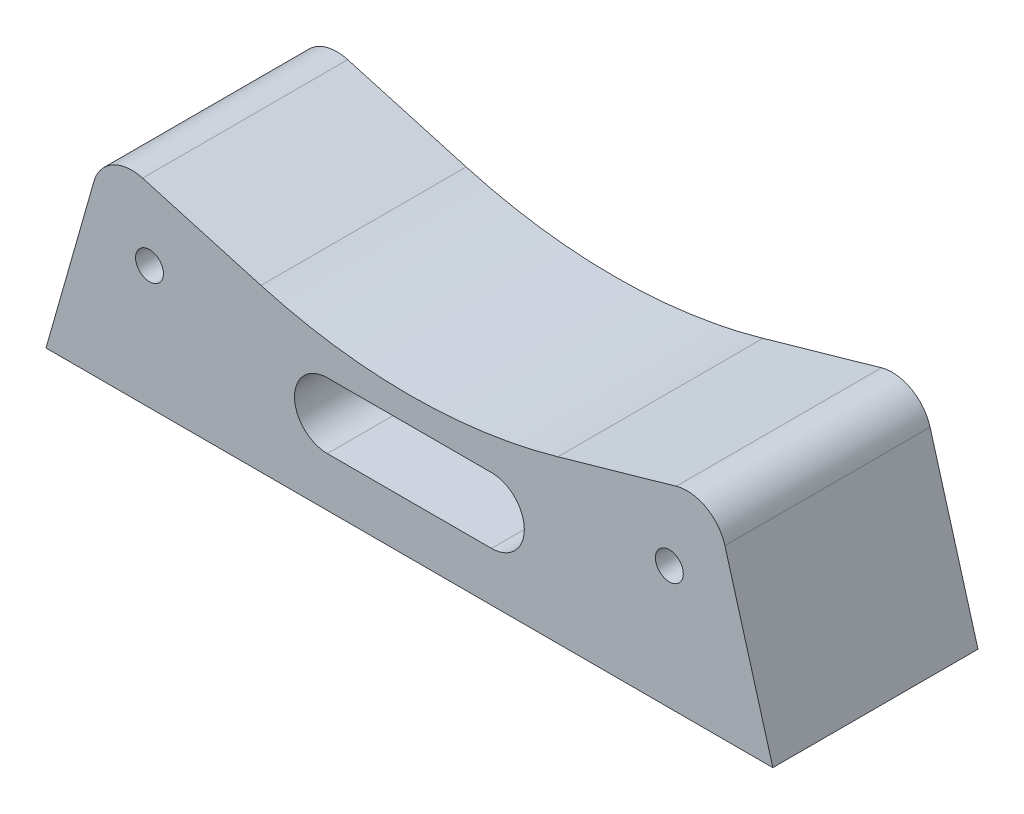
ISO-10303-21;
HEADER;
FILE_DESCRIPTION(('STEP AP214'),'2;1');
FILE_NAME('part.step','',(''),(''),'','','');
FILE_SCHEMA(('AUTOMOTIVE_DESIGN { 1 0 10303 214 1 1 1 1 }'));
ENDSEC;
DATA;
#1=APPLICATION_CONTEXT('core data for automotive mechanical design processes');
#2=APPLICATION_PROTOCOL_DEFINITION('international standard','automotive_design',2000,#1);
#3=PRODUCT_CONTEXT('',#1,'mechanical');
#4=PRODUCT('Part','Part','',(#3));
#5=PRODUCT_RELATED_PRODUCT_CATEGORY('part','',(#4));
#6=PRODUCT_DEFINITION_FORMATION('','',#4);
#7=PRODUCT_DEFINITION_CONTEXT('part definition',#1,'design');
#8=PRODUCT_DEFINITION('design','',#6,#7);
#9=PRODUCT_DEFINITION_SHAPE('','',#8);
#10=(LENGTH_UNIT() NAMED_UNIT(*) SI_UNIT(.MILLI.,.METRE.));
#11=(NAMED_UNIT(*) PLANE_ANGLE_UNIT() SI_UNIT($,.RADIAN.));
#12=(NAMED_UNIT(*) SI_UNIT($,.STERADIAN.) SOLID_ANGLE_UNIT());
#13=UNCERTAINTY_MEASURE_WITH_UNIT(LENGTH_MEASURE(1.E-05),#10,'distance_accuracy_value','');
#14=(GEOMETRIC_REPRESENTATION_CONTEXT(3) GLOBAL_UNCERTAINTY_ASSIGNED_CONTEXT((#13)) GLOBAL_UNIT_ASSIGNED_CONTEXT((#10,
#11,#12)) REPRESENTATION_CONTEXT('',''));
#15=CARTESIAN_POINT('',(0.,0.,0.));
#16=DIRECTION('',(0.,0.,1.));
#17=DIRECTION('',(1.,0.,0.));
#18=AXIS2_PLACEMENT_3D('',#15,#16,#17);
#19=CARTESIAN_POINT('',(0.,33.25,0.));
#20=DIRECTION('',(0.,0.,-1.));
#21=DIRECTION('',(1.,0.,0.));
#22=AXIS2_PLACEMENT_3D('',#19,#20,#21);
#23=PLANE('',#22);
#24=CARTESIAN_POINT('',(-31.6699809108214,-35.,0.));
#25=DIRECTION('',(0.,0.,-1.));
#26=DIRECTION('',(0.,1.,0.));
#27=AXIS2_PLACEMENT_3D('',#24,#25,#26);
#28=CIRCLE('',#27,1.7);
#29=CARTESIAN_POINT('',(-31.6699809108214,-33.3,0.));
#30=VERTEX_POINT('',#29);
#31=EDGE_CURVE('E148',#30,#30,#28,.T.);
#32=ORIENTED_EDGE('',*,*,#31,.F.);
#33=EDGE_LOOP('',(#32));
#34=FACE_BOUND('',#33,.T.);
#35=CARTESIAN_POINT('',(31.6699809108214,-35.,0.));
#36=DIRECTION('',(0.,0.,-1.));
#37=DIRECTION('',(0.,1.,0.));
#38=AXIS2_PLACEMENT_3D('',#35,#36,#37);
#39=CIRCLE('',#38,1.7);
#40=CARTESIAN_POINT('',(31.6699809108214,-33.3,0.));
#41=VERTEX_POINT('',#40);
#42=EDGE_CURVE('E276',#41,#41,#39,.T.);
#43=ORIENTED_EDGE('',*,*,#42,.F.);
#44=EDGE_LOOP('',(#43));
#45=FACE_BOUND('',#44,.T.);
#46=DIRECTION('',(-1.,0.,0.));
#47=VECTOR('',#46,1.);
#48=CARTESIAN_POINT('',(0.,-44.,0.));
#49=LINE('',#48,#47);
#50=CARTESIAN_POINT('',(10.,-44.,0.));
#51=VERTEX_POINT('',#50);
#52=CARTESIAN_POINT('',(-10.,-44.,0.));
#53=VERTEX_POINT('',#52);
#54=EDGE_CURVE('E51',#51,#53,#49,.T.);
#55=ORIENTED_EDGE('',*,*,#54,.F.);
#56=CARTESIAN_POINT('',(10.,-40.,0.));
#57=DIRECTION('',(0.,0.,-1.));
#58=DIRECTION('',(0.,1.,0.));
#59=AXIS2_PLACEMENT_3D('',#56,#57,#58);
#60=CIRCLE('',#59,4.);
#61=CARTESIAN_POINT('',(10.,-36.,0.));
#62=VERTEX_POINT('',#61);
#63=EDGE_CURVE('E142',#62,#51,#60,.T.);
#64=ORIENTED_EDGE('',*,*,#63,.F.);
#65=DIRECTION('',(1.,0.,0.));
#66=VECTOR('',#65,1.);
#67=CARTESIAN_POINT('',(0.,-36.,0.));
#68=LINE('',#67,#66);
#69=CARTESIAN_POINT('',(-10.,-36.,0.));
#70=VERTEX_POINT('',#69);
#71=EDGE_CURVE('E145',#70,#62,#68,.T.);
#72=ORIENTED_EDGE('',*,*,#71,.F.);
#73=CARTESIAN_POINT('',(-10.,-40.,0.));
#74=DIRECTION('',(0.,0.,-1.));
#75=DIRECTION('',(0.,1.,0.));
#76=AXIS2_PLACEMENT_3D('',#73,#74,#75);
#77=CIRCLE('',#76,4.);
#78=EDGE_CURVE('E154',#53,#70,#77,.T.);
#79=ORIENTED_EDGE('',*,*,#78,.F.);
#80=EDGE_LOOP('',(#55,#64,#72,#79));
#81=FACE_BOUND('',#80,.T.);
#82=DIRECTION('',(-0.273752373787154,-0.961800206823589,0.));
#83=VECTOR('',#82,1.);
#84=CARTESIAN_POINT('',(-38.4432268567544,-29.4880990498588,0.));
#85=LINE('',#84,#83);
#86=CARTESIAN_POINT('',(-38.4432268567544,-29.4880990498588,0.));
#87=VERTEX_POINT('',#86);
#88=CARTESIAN_POINT('',(-44.2814264497163,-49.9999999999999,0.));
#89=VERTEX_POINT('',#88);
#90=EDGE_CURVE('E44',#87,#89,#85,.T.);
#91=ORIENTED_EDGE('',*,*,#90,.F.);
#92=CARTESIAN_POINT('',(-33.8265858640012,-30.8021104440371,0.));
#93=DIRECTION('',(0.,0.,-1.));
#94=DIRECTION('',(0.,1.,0.));
#95=AXIS2_PLACEMENT_3D('',#92,#93,#94);
#96=CIRCLE('',#95,4.8);
#97=CARTESIAN_POINT('',(-32.5125744698229,-26.1854694512839,0.));
#98=VERTEX_POINT('',#97);
#99=EDGE_CURVE('E194',#98,#87,#96,.F.);
#100=ORIENTED_EDGE('',*,*,#99,.F.);
#101=DIRECTION('',(-0.961800206823589,0.273752373787153,0.));
#102=VECTOR('',#101,1.);
#103=CARTESIAN_POINT('',(-18.085571367469,-30.2917550580912,0.));
#104=LINE('',#103,#102);
#105=CARTESIAN_POINT('',(-18.085571367469,-30.2917550580913,0.));
#106=VERTEX_POINT('',#105);
#107=EDGE_CURVE('E198',#106,#98,#104,.T.);
#108=ORIENTED_EDGE('',*,*,#107,.F.);
#109=CARTESIAN_POINT('',(0.,33.25,0.));
#110=DIRECTION('',(0.,0.,-1.));
#111=DIRECTION('',(0.,1.,0.));
#112=AXIS2_PLACEMENT_3D('',#109,#110,#111);
#113=CIRCLE('',#112,66.0654412499476);
#114=CARTESIAN_POINT('',(18.0855713674689,-30.2917550580913,0.));
#115=VERTEX_POINT('',#114);
#116=EDGE_CURVE('E202',#115,#106,#113,.T.);
#117=ORIENTED_EDGE('',*,*,#116,.F.);
#118=DIRECTION('',(-0.961800206823589,-0.273752373787155,0.));
#119=VECTOR('',#118,1.);
#120=CARTESIAN_POINT('',(18.0855713674689,-30.2917550580913,0.));
#121=LINE('',#120,#119);
#122=CARTESIAN_POINT('',(32.5125744698227,-26.185469451284,0.));
#123=VERTEX_POINT('',#122);
#124=EDGE_CURVE('E206',#123,#115,#121,.T.);
#125=ORIENTED_EDGE('',*,*,#124,.F.);
#126=CARTESIAN_POINT('',(33.8265858640011,-30.8021104440372,0.));
#127=DIRECTION('',(0.,0.,-1.));
#128=DIRECTION('',(0.,1.,0.));
#129=AXIS2_PLACEMENT_3D('',#126,#127,#128);
#130=CIRCLE('',#129,4.80000000000001);
#131=CARTESIAN_POINT('',(38.4432268567543,-29.4880990498589,0.));
#132=VERTEX_POINT('',#131);
#133=EDGE_CURVE('E210',#132,#123,#130,.F.);
#134=ORIENTED_EDGE('',*,*,#133,.F.);
#135=DIRECTION('',(-0.273752373787153,0.961800206823589,0.));
#136=VECTOR('',#135,1.);
#137=CARTESIAN_POINT('',(38.4432268567543,-29.4880990498589,0.));
#138=LINE('',#137,#136);
#139=CARTESIAN_POINT('',(44.2814264497161,-50.,0.));
#140=VERTEX_POINT('',#139);
#141=EDGE_CURVE('E214',#140,#132,#138,.T.);
#142=ORIENTED_EDGE('',*,*,#141,.F.);
#143=DIRECTION('',(1.,0.,0.));
#144=VECTOR('',#143,1.);
#145=CARTESIAN_POINT('',(-44.2814264497163,-49.9999999999999,0.));
#146=LINE('',#145,#144);
#147=EDGE_CURVE('E167',#89,#140,#146,.T.);
#148=ORIENTED_EDGE('',*,*,#147,.F.);
#149=EDGE_LOOP('',(#91,#100,#108,#117,#125,#134,#142,#148));
#150=FACE_BOUND('',#149,.T.);
#151=ADVANCED_FACE('F37',(#34,#45,#81,#150),#23,.T.);
#152=CARTESIAN_POINT('',(33.8265858640011,-30.8021104440372,25.));
#153=DIRECTION('',(0.,0.,1.));
#154=DIRECTION('',(1.,0.,0.));
#155=AXIS2_PLACEMENT_3D('',#152,#153,#154);
#156=PLANE('',#155);
#157=CARTESIAN_POINT('',(-31.6699809108214,-35.,25.));
#158=DIRECTION('',(0.,0.,-1.));
#159=DIRECTION('',(0.,1.,0.));
#160=AXIS2_PLACEMENT_3D('',#157,#158,#159);
#161=CIRCLE('',#160,1.7);
#162=CARTESIAN_POINT('',(-31.6699809108214,-33.3,25.));
#163=VERTEX_POINT('',#162);
#164=EDGE_CURVE('E309',#163,#163,#161,.T.);
#165=ORIENTED_EDGE('',*,*,#164,.T.);
#166=EDGE_LOOP('',(#165));
#167=FACE_BOUND('',#166,.T.);
#168=CARTESIAN_POINT('',(31.6699809108214,-35.,25.));
#169=DIRECTION('',(0.,0.,-1.));
#170=DIRECTION('',(0.,1.,0.));
#171=AXIS2_PLACEMENT_3D('',#168,#169,#170);
#172=CIRCLE('',#171,1.7);
#173=CARTESIAN_POINT('',(31.6699809108214,-33.3,25.));
#174=VERTEX_POINT('',#173);
#175=EDGE_CURVE('E307',#174,#174,#172,.T.);
#176=ORIENTED_EDGE('',*,*,#175,.T.);
#177=EDGE_LOOP('',(#176));
#178=FACE_BOUND('',#177,.T.);
#179=DIRECTION('',(-1.,0.,0.));
#180=VECTOR('',#179,1.);
#181=CARTESIAN_POINT('',(0.,-44.,25.));
#182=LINE('',#181,#180);
#183=CARTESIAN_POINT('',(10.,-44.,25.));
#184=VERTEX_POINT('',#183);
#185=CARTESIAN_POINT('',(-10.,-44.,25.));
#186=VERTEX_POINT('',#185);
#187=EDGE_CURVE('E126',#184,#186,#182,.T.);
#188=ORIENTED_EDGE('',*,*,#187,.T.);
#189=CARTESIAN_POINT('',(-10.,-40.,25.));
#190=DIRECTION('',(0.,0.,-1.));
#191=DIRECTION('',(0.,1.,0.));
#192=AXIS2_PLACEMENT_3D('',#189,#190,#191);
#193=CIRCLE('',#192,4.);
#194=CARTESIAN_POINT('',(-10.,-36.,25.));
#195=VERTEX_POINT('',#194);
#196=EDGE_CURVE('E135',#186,#195,#193,.T.);
#197=ORIENTED_EDGE('',*,*,#196,.T.);
#198=DIRECTION('',(1.,0.,0.));
#199=VECTOR('',#198,1.);
#200=CARTESIAN_POINT('',(0.,-36.,25.));
#201=LINE('',#200,#199);
#202=CARTESIAN_POINT('',(10.,-36.,25.));
#203=VERTEX_POINT('',#202);
#204=EDGE_CURVE('E59',#195,#203,#201,.T.);
#205=ORIENTED_EDGE('',*,*,#204,.T.);
#206=CARTESIAN_POINT('',(10.,-40.,25.));
#207=DIRECTION('',(0.,0.,-1.));
#208=DIRECTION('',(0.,1.,0.));
#209=AXIS2_PLACEMENT_3D('',#206,#207,#208);
#210=CIRCLE('',#209,4.);
#211=EDGE_CURVE('E132',#203,#184,#210,.T.);
#212=ORIENTED_EDGE('',*,*,#211,.T.);
#213=EDGE_LOOP('',(#188,#197,#205,#212));
#214=FACE_BOUND('',#213,.T.);
#215=DIRECTION('',(-0.273752373787154,-0.961800206823589,0.));
#216=VECTOR('',#215,1.);
#217=CARTESIAN_POINT('',(-38.4432268567544,-29.4880990498588,25.));
#218=LINE('',#217,#216);
#219=CARTESIAN_POINT('',(-38.4432268567544,-29.4880990498588,25.));
#220=VERTEX_POINT('',#219);
#221=CARTESIAN_POINT('',(-44.2814264497163,-49.9999999999999,25.));
#222=VERTEX_POINT('',#221);
#223=EDGE_CURVE('E160',#220,#222,#218,.T.);
#224=ORIENTED_EDGE('',*,*,#223,.T.);
#225=DIRECTION('',(1.,0.,0.));
#226=VECTOR('',#225,1.);
#227=CARTESIAN_POINT('',(-44.2814264497163,-49.9999999999999,25.));
#228=LINE('',#227,#226);
#229=CARTESIAN_POINT('',(44.2814264497161,-50.,25.));
#230=VERTEX_POINT('',#229);
#231=EDGE_CURVE('E183',#222,#230,#228,.T.);
#232=ORIENTED_EDGE('',*,*,#231,.T.);
#233=DIRECTION('',(-0.273752373787153,0.961800206823589,0.));
#234=VECTOR('',#233,1.);
#235=CARTESIAN_POINT('',(38.4432268567543,-29.4880990498589,25.));
#236=LINE('',#235,#234);
#237=CARTESIAN_POINT('',(38.4432268567543,-29.4880990498589,25.));
#238=VERTEX_POINT('',#237);
#239=EDGE_CURVE('E180',#230,#238,#236,.T.);
#240=ORIENTED_EDGE('',*,*,#239,.T.);
#241=CARTESIAN_POINT('',(33.8265858640011,-30.8021104440372,25.));
#242=DIRECTION('',(0.,0.,1.));
#243=DIRECTION('',(1.,0.,0.));
#244=AXIS2_PLACEMENT_3D('',#241,#242,#243);
#245=CIRCLE('',#244,4.80000000000001);
#246=CARTESIAN_POINT('',(32.5125744698227,-26.185469451284,25.));
#247=VERTEX_POINT('',#246);
#248=EDGE_CURVE('E177',#238,#247,#245,.T.);
#249=ORIENTED_EDGE('',*,*,#248,.T.);
#250=DIRECTION('',(-0.961800206823589,-0.273752373787155,0.));
#251=VECTOR('',#250,1.);
#252=CARTESIAN_POINT('',(18.0855713674689,-30.2917550580913,25.));
#253=LINE('',#252,#251);
#254=CARTESIAN_POINT('',(18.0855713674689,-30.2917550580913,25.));
#255=VERTEX_POINT('',#254);
#256=EDGE_CURVE('E174',#247,#255,#253,.T.);
#257=ORIENTED_EDGE('',*,*,#256,.T.);
#258=CARTESIAN_POINT('',(0.,33.25,25.));
#259=DIRECTION('',(0.,0.,-1.));
#260=DIRECTION('',(-1.,0.,0.));
#261=AXIS2_PLACEMENT_3D('',#258,#259,#260);
#262=CIRCLE('',#261,66.0654412499476);
#263=CARTESIAN_POINT('',(-18.085571367469,-30.2917550580913,25.));
#264=VERTEX_POINT('',#263);
#265=EDGE_CURVE('E171',#255,#264,#262,.T.);
#266=ORIENTED_EDGE('',*,*,#265,.T.);
#267=DIRECTION('',(-0.961800206823589,0.273752373787153,0.));
#268=VECTOR('',#267,1.);
#269=CARTESIAN_POINT('',(-18.085571367469,-30.2917550580912,25.));
#270=LINE('',#269,#268);
#271=CARTESIAN_POINT('',(-32.5125744698229,-26.1854694512839,25.));
#272=VERTEX_POINT('',#271);
#273=EDGE_CURVE('E168',#264,#272,#270,.T.);
#274=ORIENTED_EDGE('',*,*,#273,.T.);
#275=CARTESIAN_POINT('',(-33.8265858640012,-30.8021104440371,25.));
#276=DIRECTION('',(0.,0.,1.));
#277=DIRECTION('',(-1.,0.,0.));
#278=AXIS2_PLACEMENT_3D('',#275,#276,#277);
#279=CIRCLE('',#278,4.8);
#280=EDGE_CURVE('E164',#272,#220,#279,.T.);
#281=ORIENTED_EDGE('',*,*,#280,.T.);
#282=EDGE_LOOP('',(#224,#232,#240,#249,#257,#266,#274,#281));
#283=FACE_BOUND('',#282,.T.);
#284=ADVANCED_FACE('F139',(#167,#178,#214,#283),#156,.T.);
#285=CARTESIAN_POINT('',(-44.2814264497163,-49.9999999999999,-91.7566216511195));
#286=DIRECTION('',(0.,-1.,0.));
#287=DIRECTION('',(1.,0.,0.));
#288=AXIS2_PLACEMENT_3D('',#285,#286,#287);
#289=PLANE('',#288);
#290=DIRECTION('',(0.,0.,1.));
#291=VECTOR('',#290,1.);
#292=CARTESIAN_POINT('',(-44.2814264497163,-49.9999999999999,-91.7566216511195));
#293=LINE('',#292,#291);
#294=EDGE_CURVE('E11',#89,#222,#293,.T.);
#295=ORIENTED_EDGE('',*,*,#294,.F.);
#296=ORIENTED_EDGE('',*,*,#147,.T.);
#297=DIRECTION('',(0.,0.,1.));
#298=VECTOR('',#297,1.);
#299=CARTESIAN_POINT('',(44.2814264497161,-50.,-91.7566216511195));
#300=LINE('',#299,#298);
#301=EDGE_CURVE('E190',#140,#230,#300,.T.);
#302=ORIENTED_EDGE('',*,*,#301,.T.);
#303=ORIENTED_EDGE('',*,*,#231,.F.);
#304=EDGE_LOOP('',(#295,#296,#302,#303));
#305=FACE_BOUND('',#304,.T.);
#306=ADVANCED_FACE('F227',(#305),#289,.T.);
#307=CARTESIAN_POINT('',(38.4432268567543,-29.4880990498589,-91.7566216511195));
#308=DIRECTION('',(0.961800206823589,0.273752373787153,0.));
#309=DIRECTION('',(-0.273752373787153,0.961800206823589,0.));
#310=AXIS2_PLACEMENT_3D('',#307,#308,#309);
#311=PLANE('',#310);
#312=ORIENTED_EDGE('',*,*,#301,.F.);
#313=ORIENTED_EDGE('',*,*,#141,.T.);
#314=DIRECTION('',(0.,0.,1.));
#315=VECTOR('',#314,1.);
#316=CARTESIAN_POINT('',(38.4432268567543,-29.4880990498589,-91.7566216511195));
#317=LINE('',#316,#315);
#318=EDGE_CURVE('E213',#132,#238,#317,.T.);
#319=ORIENTED_EDGE('',*,*,#318,.T.);
#320=ORIENTED_EDGE('',*,*,#239,.F.);
#321=EDGE_LOOP('',(#312,#313,#319,#320));
#322=FACE_BOUND('',#321,.T.);
#323=ADVANCED_FACE('F229',(#322),#311,.T.);
#324=CARTESIAN_POINT('',(33.8265858640011,-30.8021104440372,-91.7566216511195));
#325=DIRECTION('',(0.,0.,1.));
#326=DIRECTION('',(1.,0.,0.));
#327=AXIS2_PLACEMENT_3D('',#324,#325,#326);
#328=CYLINDRICAL_SURFACE('',#327,4.80000000000001);
#329=ORIENTED_EDGE('',*,*,#318,.F.);
#330=ORIENTED_EDGE('',*,*,#133,.T.);
#331=DIRECTION('',(0.,0.,1.));
#332=VECTOR('',#331,1.);
#333=CARTESIAN_POINT('',(32.5125744698227,-26.185469451284,-91.7566216511195));
#334=LINE('',#333,#332);
#335=EDGE_CURVE('E209',#123,#247,#334,.T.);
#336=ORIENTED_EDGE('',*,*,#335,.T.);
#337=ORIENTED_EDGE('',*,*,#248,.F.);
#338=EDGE_LOOP('',(#329,#330,#336,#337));
#339=FACE_BOUND('',#338,.T.);
#340=ADVANCED_FACE('F241',(#339),#328,.T.);
#341=CARTESIAN_POINT('',(18.0855713674689,-30.2917550580913,-91.7566216511195));
#342=DIRECTION('',(-0.273752373787155,0.961800206823589,0.));
#343=DIRECTION('',(-0.961800206823589,-0.273752373787155,0.));
#344=AXIS2_PLACEMENT_3D('',#341,#342,#343);
#345=PLANE('',#344);
#346=ORIENTED_EDGE('',*,*,#335,.F.);
#347=ORIENTED_EDGE('',*,*,#124,.T.);
#348=DIRECTION('',(0.,0.,1.));
#349=VECTOR('',#348,1.);
#350=CARTESIAN_POINT('',(18.0855713674689,-30.2917550580913,-91.7566216511195));
#351=LINE('',#350,#349);
#352=EDGE_CURVE('E205',#115,#255,#351,.T.);
#353=ORIENTED_EDGE('',*,*,#352,.T.);
#354=ORIENTED_EDGE('',*,*,#256,.F.);
#355=EDGE_LOOP('',(#346,#347,#353,#354));
#356=FACE_BOUND('',#355,.T.);
#357=ADVANCED_FACE('F245',(#356),#345,.T.);
#358=CARTESIAN_POINT('',(0.,33.25,-91.7566216511195));
#359=DIRECTION('',(0.,0.,1.));
#360=DIRECTION('',(1.,0.,0.));
#361=AXIS2_PLACEMENT_3D('',#358,#359,#360);
#362=CYLINDRICAL_SURFACE('',#361,66.0654412499476);
#363=ORIENTED_EDGE('',*,*,#352,.F.);
#364=ORIENTED_EDGE('',*,*,#116,.T.);
#365=DIRECTION('',(0.,0.,1.));
#366=VECTOR('',#365,1.);
#367=CARTESIAN_POINT('',(-18.085571367469,-30.2917550580913,-91.7566216511195));
#368=LINE('',#367,#366);
#369=EDGE_CURVE('E201',#106,#264,#368,.T.);
#370=ORIENTED_EDGE('',*,*,#369,.T.);
#371=ORIENTED_EDGE('',*,*,#265,.F.);
#372=EDGE_LOOP('',(#363,#364,#370,#371));
#373=FACE_BOUND('',#372,.T.);
#374=ADVANCED_FACE('F248',(#373),#362,.F.);
#375=CARTESIAN_POINT('',(-18.085571367469,-30.2917550580912,-91.7566216511195));
#376=DIRECTION('',(0.273752373787153,0.961800206823589,0.));
#377=DIRECTION('',(-0.961800206823589,0.273752373787153,0.));
#378=AXIS2_PLACEMENT_3D('',#375,#376,#377);
#379=PLANE('',#378);
#380=ORIENTED_EDGE('',*,*,#369,.F.);
#381=ORIENTED_EDGE('',*,*,#107,.T.);
#382=DIRECTION('',(0.,0.,1.));
#383=VECTOR('',#382,1.);
#384=CARTESIAN_POINT('',(-32.5125744698229,-26.1854694512839,-91.7566216511195));
#385=LINE('',#384,#383);
#386=EDGE_CURVE('E197',#98,#272,#385,.T.);
#387=ORIENTED_EDGE('',*,*,#386,.T.);
#388=ORIENTED_EDGE('',*,*,#273,.F.);
#389=EDGE_LOOP('',(#380,#381,#387,#388));
#390=FACE_BOUND('',#389,.T.);
#391=ADVANCED_FACE('F252',(#390),#379,.T.);
#392=CARTESIAN_POINT('',(-33.8265858640012,-30.8021104440371,-91.7566216511195));
#393=DIRECTION('',(0.,0.,1.));
#394=DIRECTION('',(1.,0.,0.));
#395=AXIS2_PLACEMENT_3D('',#392,#393,#394);
#396=CYLINDRICAL_SURFACE('',#395,4.8);
#397=ORIENTED_EDGE('',*,*,#386,.F.);
#398=ORIENTED_EDGE('',*,*,#99,.T.);
#399=DIRECTION('',(0.,0.,1.));
#400=VECTOR('',#399,1.);
#401=CARTESIAN_POINT('',(-38.4432268567544,-29.4880990498588,-91.7566216511195));
#402=LINE('',#401,#400);
#403=EDGE_CURVE('E193',#87,#220,#402,.T.);
#404=ORIENTED_EDGE('',*,*,#403,.T.);
#405=ORIENTED_EDGE('',*,*,#280,.F.);
#406=EDGE_LOOP('',(#397,#398,#404,#405));
#407=FACE_BOUND('',#406,.T.);
#408=ADVANCED_FACE('F254',(#407),#396,.T.);
#409=CARTESIAN_POINT('',(-38.4432268567544,-29.4880990498588,-91.7566216511195));
#410=DIRECTION('',(-0.961800206823589,0.273752373787154,0.));
#411=DIRECTION('',(-0.273752373787154,-0.961800206823589,0.));
#412=AXIS2_PLACEMENT_3D('',#409,#410,#411);
#413=PLANE('',#412);
#414=ORIENTED_EDGE('',*,*,#403,.F.);
#415=ORIENTED_EDGE('',*,*,#90,.T.);
#416=ORIENTED_EDGE('',*,*,#294,.T.);
#417=ORIENTED_EDGE('',*,*,#223,.F.);
#418=EDGE_LOOP('',(#414,#415,#416,#417));
#419=FACE_BOUND('',#418,.T.);
#420=ADVANCED_FACE('F236',(#419),#413,.T.);
#421=CARTESIAN_POINT('',(0.,-44.,25.));
#422=DIRECTION('',(0.,-1.,0.));
#423=DIRECTION('',(0.,0.,-1.));
#424=AXIS2_PLACEMENT_3D('',#421,#422,#423);
#425=PLANE('',#424);
#426=ORIENTED_EDGE('',*,*,#54,.T.);
#427=DIRECTION('',(0.,0.,-1.));
#428=VECTOR('',#427,1.);
#429=CARTESIAN_POINT('',(-10.,-44.,25.));
#430=LINE('',#429,#428);
#431=EDGE_CURVE('E122',#186,#53,#430,.T.);
#432=ORIENTED_EDGE('',*,*,#431,.F.);
#433=ORIENTED_EDGE('',*,*,#187,.F.);
#434=DIRECTION('',(0.,0.,-1.));
#435=VECTOR('',#434,1.);
#436=CARTESIAN_POINT('',(10.,-44.,25.));
#437=LINE('',#436,#435);
#438=EDGE_CURVE('E158',#184,#51,#437,.T.);
#439=ORIENTED_EDGE('',*,*,#438,.T.);
#440=EDGE_LOOP('',(#426,#432,#433,#439));
#441=FACE_BOUND('',#440,.T.);
#442=ADVANCED_FACE('F124',(#441),#425,.F.);
#443=CARTESIAN_POINT('',(10.,-40.,25.));
#444=DIRECTION('',(0.,0.,-1.));
#445=DIRECTION('',(0.,1.,0.));
#446=AXIS2_PLACEMENT_3D('',#443,#444,#445);
#447=CYLINDRICAL_SURFACE('',#446,4.);
#448=ORIENTED_EDGE('',*,*,#63,.T.);
#449=ORIENTED_EDGE('',*,*,#438,.F.);
#450=ORIENTED_EDGE('',*,*,#211,.F.);
#451=DIRECTION('',(0.,0.,-1.));
#452=VECTOR('',#451,1.);
#453=CARTESIAN_POINT('',(10.,-36.,25.));
#454=LINE('',#453,#452);
#455=EDGE_CURVE('E161',#203,#62,#454,.T.);
#456=ORIENTED_EDGE('',*,*,#455,.T.);
#457=EDGE_LOOP('',(#448,#449,#450,#456));
#458=FACE_BOUND('',#457,.T.);
#459=ADVANCED_FACE('F281',(#458),#447,.F.);
#460=CARTESIAN_POINT('',(0.,-36.,25.));
#461=DIRECTION('',(0.,1.,0.));
#462=DIRECTION('',(0.,0.,1.));
#463=AXIS2_PLACEMENT_3D('',#460,#461,#462);
#464=PLANE('',#463);
#465=ORIENTED_EDGE('',*,*,#71,.T.);
#466=ORIENTED_EDGE('',*,*,#455,.F.);
#467=ORIENTED_EDGE('',*,*,#204,.F.);
#468=DIRECTION('',(0.,0.,-1.));
#469=VECTOR('',#468,1.);
#470=CARTESIAN_POINT('',(-10.,-36.,25.));
#471=LINE('',#470,#469);
#472=EDGE_CURVE('E131',#195,#70,#471,.T.);
#473=ORIENTED_EDGE('',*,*,#472,.T.);
#474=EDGE_LOOP('',(#465,#466,#467,#473));
#475=FACE_BOUND('',#474,.T.);
#476=ADVANCED_FACE('F279',(#475),#464,.F.);
#477=CARTESIAN_POINT('',(-10.,-40.,25.));
#478=DIRECTION('',(0.,0.,-1.));
#479=DIRECTION('',(0.,1.,0.));
#480=AXIS2_PLACEMENT_3D('',#477,#478,#479);
#481=CYLINDRICAL_SURFACE('',#480,4.);
#482=ORIENTED_EDGE('',*,*,#78,.T.);
#483=ORIENTED_EDGE('',*,*,#472,.F.);
#484=ORIENTED_EDGE('',*,*,#196,.F.);
#485=ORIENTED_EDGE('',*,*,#431,.T.);
#486=EDGE_LOOP('',(#482,#483,#484,#485));
#487=FACE_BOUND('',#486,.T.);
#488=ADVANCED_FACE('F136',(#487),#481,.F.);
#489=CARTESIAN_POINT('',(31.6699809108214,-35.,25.));
#490=DIRECTION('',(0.,0.,-1.));
#491=DIRECTION('',(0.,1.,0.));
#492=AXIS2_PLACEMENT_3D('',#489,#490,#491);
#493=CYLINDRICAL_SURFACE('',#492,1.7);
#494=ORIENTED_EDGE('',*,*,#42,.T.);
#495=EDGE_LOOP('',(#494));
#496=FACE_BOUND('',#495,.T.);
#497=ORIENTED_EDGE('',*,*,#175,.F.);
#498=EDGE_LOOP('',(#497));
#499=FACE_BOUND('',#498,.T.);
#500=ADVANCED_FACE('F291',(#496,#499),#493,.F.);
#501=CARTESIAN_POINT('',(-31.6699809108214,-35.,25.));
#502=DIRECTION('',(0.,0.,-1.));
#503=DIRECTION('',(0.,1.,0.));
#504=AXIS2_PLACEMENT_3D('',#501,#502,#503);
#505=CYLINDRICAL_SURFACE('',#504,1.7);
#506=ORIENTED_EDGE('',*,*,#31,.T.);
#507=EDGE_LOOP('',(#506));
#508=FACE_BOUND('',#507,.T.);
#509=ORIENTED_EDGE('',*,*,#164,.F.);
#510=EDGE_LOOP('',(#509));
#511=FACE_BOUND('',#510,.T.);
#512=ADVANCED_FACE('F298',(#508,#511),#505,.F.);
#513=CLOSED_SHELL('',(#151,#284,#306,#323,#340,#357,#374,#391,#408,#420,#442,#459,#476,#488,
#500,#512));
#514=MANIFOLD_SOLID_BREP('B2',#513);
#515=ADVANCED_BREP_SHAPE_REPRESENTATION('',(#18,#514),#14);
#516=SHAPE_DEFINITION_REPRESENTATION(#9,#515);
ENDSEC;
END-ISO-10303-21;
